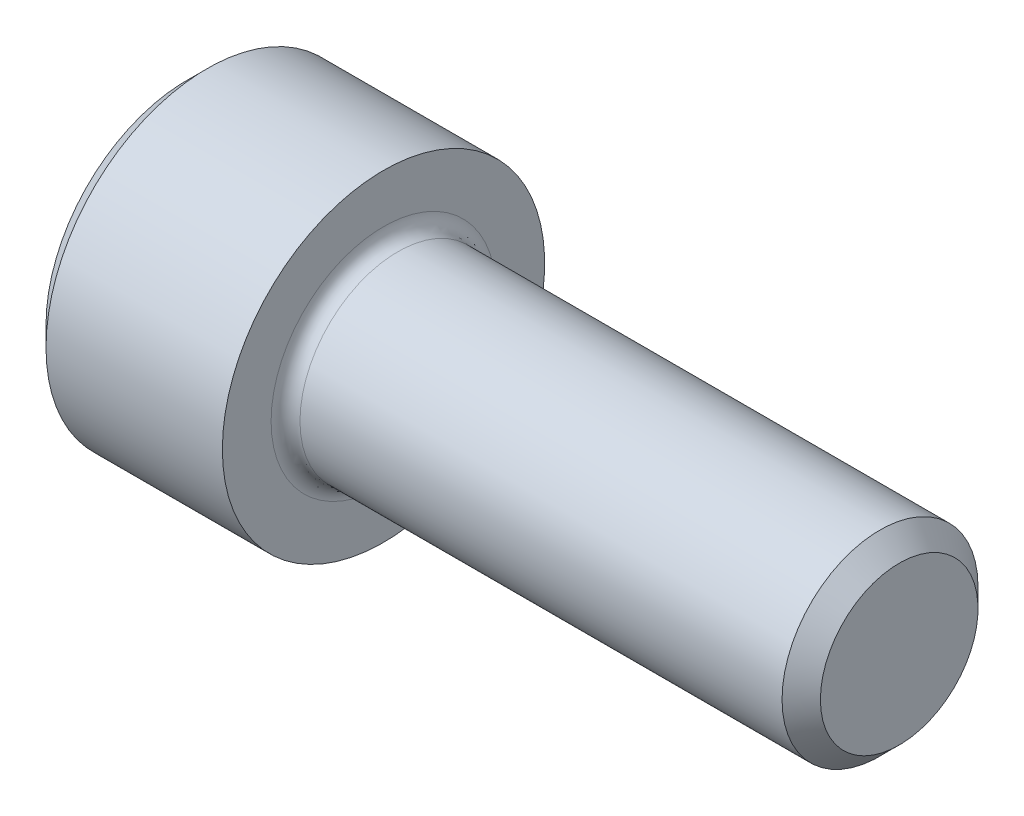
ISO-10303-21;
HEADER;
FILE_DESCRIPTION(('STEP AP214'),'2;1');
FILE_NAME('part.step','',(''),(''),'','','');
FILE_SCHEMA(('AUTOMOTIVE_DESIGN { 1 0 10303 214 1 1 1 1 }'));
ENDSEC;
DATA;
#1=APPLICATION_CONTEXT('core data for automotive mechanical design processes');
#2=APPLICATION_PROTOCOL_DEFINITION('international standard','automotive_design',2000,#1);
#3=PRODUCT_CONTEXT('',#1,'mechanical');
#4=PRODUCT('Part','Part','',(#3));
#5=PRODUCT_RELATED_PRODUCT_CATEGORY('part','',(#4));
#6=PRODUCT_DEFINITION_FORMATION('','',#4);
#7=PRODUCT_DEFINITION_CONTEXT('part definition',#1,'design');
#8=PRODUCT_DEFINITION('design','',#6,#7);
#9=PRODUCT_DEFINITION_SHAPE('','',#8);
#10=(LENGTH_UNIT() NAMED_UNIT(*) SI_UNIT(.MILLI.,.METRE.));
#11=(NAMED_UNIT(*) PLANE_ANGLE_UNIT() SI_UNIT($,.RADIAN.));
#12=(NAMED_UNIT(*) SI_UNIT($,.STERADIAN.) SOLID_ANGLE_UNIT());
#13=UNCERTAINTY_MEASURE_WITH_UNIT(LENGTH_MEASURE(1.E-05),#10,'distance_accuracy_value','');
#14=(GEOMETRIC_REPRESENTATION_CONTEXT(3) GLOBAL_UNCERTAINTY_ASSIGNED_CONTEXT((#13)) GLOBAL_UNIT_ASSIGNED_CONTEXT((#10,
#11,#12)) REPRESENTATION_CONTEXT('',''));
#15=CARTESIAN_POINT('',(0.,0.,0.));
#16=DIRECTION('',(0.,0.,1.));
#17=DIRECTION('',(1.,0.,0.));
#18=AXIS2_PLACEMENT_3D('',#15,#16,#17);
#19=CARTESIAN_POINT('',(17.5259999996129,0.,0.));
#20=DIRECTION('',(1.,0.,0.));
#21=DIRECTION('',(0.,0.,-1.));
#22=AXIS2_PLACEMENT_3D('',#19,#20,#21);
#23=PLANE('',#22);
#24=CARTESIAN_POINT('',(17.526,0.,0.));
#25=DIRECTION('',(-1.,0.,0.));
#26=DIRECTION('',(0.,0.,1.));
#27=AXIS2_PLACEMENT_3D('',#24,#25,#26);
#28=CIRCLE('',#27,1.94056);
#29=CARTESIAN_POINT('',(17.526,0.,1.94056));
#30=VERTEX_POINT('',#29);
#31=EDGE_CURVE('E138',#30,#30,#28,.F.);
#32=ORIENTED_EDGE('',*,*,#31,.T.);
#33=EDGE_LOOP('',(#32));
#34=FACE_BOUND('',#33,.T.);
#35=ADVANCED_FACE('F17',(#34),#23,.T.);
#36=CARTESIAN_POINT('',(17.526,0.,0.));
#37=DIRECTION('',(-1.,0.,0.));
#38=DIRECTION('',(0.,0.,1.));
#39=AXIS2_PLACEMENT_3D('',#36,#37,#38);
#40=CONICAL_SURFACE('',#39,1.94056,0.785398163397448);
#41=ORIENTED_EDGE('',*,*,#31,.F.);
#42=EDGE_LOOP('',(#41));
#43=FACE_BOUND('',#42,.T.);
#44=CARTESIAN_POINT('',(17.05356,0.,0.));
#45=DIRECTION('',(-1.,0.,0.));
#46=DIRECTION('',(0.,0.,-1.));
#47=AXIS2_PLACEMENT_3D('',#44,#45,#46);
#48=CIRCLE('',#47,2.413);
#49=CARTESIAN_POINT('',(17.05356,0.,-2.413));
#50=VERTEX_POINT('',#49);
#51=EDGE_CURVE('E140',#50,#50,#48,.F.);
#52=ORIENTED_EDGE('',*,*,#51,.T.);
#53=EDGE_LOOP('',(#52));
#54=FACE_BOUND('',#53,.T.);
#55=ADVANCED_FACE('F509',(#43,#54),#40,.T.);
#56=CARTESIAN_POINT('',(17.05356,0.,0.));
#57=DIRECTION('',(-1.,0.,0.));
#58=DIRECTION('',(0.,0.,1.));
#59=AXIS2_PLACEMENT_3D('',#56,#57,#58);
#60=CYLINDRICAL_SURFACE('',#59,2.413);
#61=ORIENTED_EDGE('',*,*,#51,.F.);
#62=EDGE_LOOP('',(#61));
#63=FACE_BOUND('',#62,.T.);
#64=CARTESIAN_POINT('',(5.1816,0.,0.));
#65=DIRECTION('',(1.,0.,0.));
#66=DIRECTION('',(0.,0.,1.));
#67=AXIS2_PLACEMENT_3D('',#64,#65,#66);
#68=CIRCLE('',#67,2.413);
#69=CARTESIAN_POINT('',(5.1816,0.,2.413));
#70=VERTEX_POINT('',#69);
#71=EDGE_CURVE('E150',#70,#70,#68,.T.);
#72=ORIENTED_EDGE('',*,*,#71,.T.);
#73=EDGE_LOOP('',(#72));
#74=FACE_BOUND('',#73,.T.);
#75=ADVANCED_FACE('F179',(#63,#74),#60,.T.);
#76=CARTESIAN_POINT('',(5.1816,0.,2.413));
#77=CARTESIAN_POINT('',(4.97329434277987,0.,2.413));
#78=CARTESIAN_POINT('',(4.826,0.,2.56029434277987));
#79=CARTESIAN_POINT('',(4.826,0.,2.7686));
#80=(BOUNDED_CURVE() B_SPLINE_CURVE(3,(#76,#77,#78,#79),.UNSPECIFIED.,.F.,
.F.) B_SPLINE_CURVE_WITH_KNOTS((4,4),(0.,1.),
.UNSPECIFIED.) CURVE() GEOMETRIC_REPRESENTATION_ITEM() RATIONAL_B_SPLINE_CURVE((1.,
0.804737854124365,0.804737854124365,1.)) REPRESENTATION_ITEM(''));
#81=CARTESIAN_POINT('',(5.1816,0.,0.));
#82=DIRECTION('',(1.,0.,0.));
#83=AXIS1_PLACEMENT('',#81,#82);
#84=SURFACE_OF_REVOLUTION('',#80,#83);
#85=CARTESIAN_POINT('',(4.826,0.,0.));
#86=DIRECTION('',(1.,0.,0.));
#87=DIRECTION('',(0.,0.,1.));
#88=AXIS2_PLACEMENT_3D('',#85,#86,#87);
#89=CIRCLE('',#88,2.7686);
#90=CARTESIAN_POINT('',(4.82600000010323,0.,2.7686));
#91=VERTEX_POINT('',#90);
#92=CARTESIAN_POINT('',(4.82600000010323,0.,-2.7686));
#93=VERTEX_POINT('',#92);
#94=EDGE_CURVE('E137',#91,#93,#89,.T.);
#95=ORIENTED_EDGE('',*,*,#94,.T.);
#96=CARTESIAN_POINT('',(4.826,0.,0.));
#97=DIRECTION('',(1.,0.,0.));
#98=DIRECTION('',(0.,0.,-1.));
#99=AXIS2_PLACEMENT_3D('',#96,#97,#98);
#100=CIRCLE('',#99,2.7686);
#101=EDGE_CURVE('E143',#93,#91,#100,.T.);
#102=ORIENTED_EDGE('',*,*,#101,.T.);
#103=EDGE_LOOP('',(#95,#102));
#104=FACE_BOUND('',#103,.T.);
#105=ORIENTED_EDGE('',*,*,#71,.F.);
#106=EDGE_LOOP('',(#105));
#107=FACE_BOUND('',#106,.T.);
#108=ADVANCED_FACE('F145',(#104,#107),#84,.F.);
#109=CARTESIAN_POINT('',(4.82600000025806,0.,0.));
#110=DIRECTION('',(1.,0.,0.));
#111=DIRECTION('',(0.,0.,-1.));
#112=AXIS2_PLACEMENT_3D('',#109,#110,#111);
#113=PLANE('',#112);
#114=ORIENTED_EDGE('',*,*,#101,.F.);
#115=ORIENTED_EDGE('',*,*,#94,.F.);
#116=EDGE_LOOP('',(#114,#115));
#117=FACE_BOUND('',#116,.T.);
#118=CARTESIAN_POINT('',(4.826,0.,0.));
#119=DIRECTION('',(-1.,0.,0.));
#120=DIRECTION('',(0.,0.,1.));
#121=AXIS2_PLACEMENT_3D('',#118,#119,#120);
#122=CIRCLE('',#121,3.96875);
#123=CARTESIAN_POINT('',(4.826,0.,3.96875));
#124=VERTEX_POINT('',#123);
#125=EDGE_CURVE('E133',#124,#124,#122,.F.);
#126=ORIENTED_EDGE('',*,*,#125,.T.);
#127=EDGE_LOOP('',(#126));
#128=FACE_BOUND('',#127,.T.);
#129=ADVANCED_FACE('F152',(#117,#128),#113,.T.);
#130=CARTESIAN_POINT('',(4.826,0.,0.));
#131=DIRECTION('',(-1.,0.,0.));
#132=DIRECTION('',(0.,0.,1.));
#133=AXIS2_PLACEMENT_3D('',#130,#131,#132);
#134=CYLINDRICAL_SURFACE('',#133,3.96875);
#135=ORIENTED_EDGE('',*,*,#125,.F.);
#136=EDGE_LOOP('',(#135));
#137=FACE_BOUND('',#136,.T.);
#138=CARTESIAN_POINT('',(0.4826,0.,0.));
#139=DIRECTION('',(1.,0.,0.));
#140=DIRECTION('',(0.,0.,-1.));
#141=AXIS2_PLACEMENT_3D('',#138,#139,#140);
#142=CIRCLE('',#141,3.96875);
#143=CARTESIAN_POINT('',(0.4826,0.,-3.96875));
#144=VERTEX_POINT('',#143);
#145=CARTESIAN_POINT('',(0.4826,0.,3.96875));
#146=VERTEX_POINT('',#145);
#147=EDGE_CURVE('E136',#144,#146,#142,.T.);
#148=ORIENTED_EDGE('',*,*,#147,.T.);
#149=CARTESIAN_POINT('',(0.4826,0.,0.));
#150=DIRECTION('',(1.,0.,0.));
#151=DIRECTION('',(0.,0.,1.));
#152=AXIS2_PLACEMENT_3D('',#149,#150,#151);
#153=CIRCLE('',#152,3.96875);
#154=EDGE_CURVE('E121',#146,#144,#153,.T.);
#155=ORIENTED_EDGE('',*,*,#154,.T.);
#156=EDGE_LOOP('',(#148,#155));
#157=FACE_BOUND('',#156,.T.);
#158=ADVANCED_FACE('F173',(#137,#157),#134,.T.);
#159=CARTESIAN_POINT('',(0.,0.,0.));
#160=DIRECTION('',(1.,0.,0.));
#161=DIRECTION('',(0.,0.,-1.));
#162=AXIS2_PLACEMENT_3D('',#159,#160,#161);
#163=CONICAL_SURFACE('',#162,3.48615,0.785398163397448);
#164=DIRECTION('',(0.707106781246854,0.,0.707106781126241));
#165=VECTOR('',#164,1.);
#166=CARTESIAN_POINT('',(0.241299999958841,0.,3.72745));
#167=LINE('',#166,#165);
#168=CARTESIAN_POINT('',(0.,0.,3.48615000004116));
#169=VERTEX_POINT('',#168);
#170=EDGE_CURVE('E112',#169,#146,#167,.T.);
#171=ORIENTED_EDGE('',*,*,#170,.T.);
#172=ORIENTED_EDGE('',*,*,#147,.F.);
#173=DIRECTION('',(-0.707106781246854,0.,0.707106781126241));
#174=VECTOR('',#173,1.);
#175=CARTESIAN_POINT('',(0.241299999958841,0.,-3.72745));
#176=LINE('',#175,#174);
#177=CARTESIAN_POINT('',(-2.05793803479181E-11,0.,-3.48615000006174));
#178=VERTEX_POINT('',#177);
#179=EDGE_CURVE('E105',#144,#178,#176,.T.);
#180=ORIENTED_EDGE('',*,*,#179,.T.);
#181=CARTESIAN_POINT('',(0.,0.,0.));
#182=DIRECTION('',(1.,0.,0.));
#183=DIRECTION('',(0.,0.,-1.));
#184=AXIS2_PLACEMENT_3D('',#181,#182,#183);
#185=CIRCLE('',#184,3.48615);
#186=EDGE_CURVE('E109',#178,#169,#185,.T.);
#187=ORIENTED_EDGE('',*,*,#186,.T.);
#188=EDGE_LOOP('',(#171,#172,#180,#187));
#189=FACE_BOUND('',#188,.T.);
#190=ADVANCED_FACE('F111',(#189),#163,.T.);
#191=CARTESIAN_POINT('',(-8.23180635068E-11,0.,0.));
#192=DIRECTION('',(1.,0.,0.));
#193=DIRECTION('',(0.,0.,-1.));
#194=AXIS2_PLACEMENT_3D('',#191,#192,#193);
#195=CONICAL_SURFACE('',#194,3.48615,0.785398163312162);
#196=CARTESIAN_POINT('',(-4.11587878008906E-11,0.,0.));
#197=DIRECTION('',(1.,0.,0.));
#198=DIRECTION('',(0.,0.,-1.));
#199=AXIS2_PLACEMENT_3D('',#196,#197,#198);
#200=CIRCLE('',#199,3.48615000004116);
#201=EDGE_CURVE('E116',#169,#178,#200,.T.);
#202=ORIENTED_EDGE('',*,*,#201,.T.);
#203=ORIENTED_EDGE('',*,*,#179,.F.);
#204=ORIENTED_EDGE('',*,*,#154,.F.);
#205=ORIENTED_EDGE('',*,*,#170,.F.);
#206=EDGE_LOOP('',(#202,#203,#204,#205));
#207=FACE_BOUND('',#206,.T.);
#208=ADVANCED_FACE('F120',(#207),#195,.T.);
#209=CARTESIAN_POINT('',(0.,-1.71906908697358,0.992505000056698));
#210=DIRECTION('',(0.,0.866025403798195,-0.499999999976173));
#211=DIRECTION('',(0.,0.499999999976173,0.866025403798195));
#212=AXIS2_PLACEMENT_3D('',#209,#210,#211);
#213=PLANE('',#212);
#214=DIRECTION('',(1.,0.,0.));
#215=VECTOR('',#214,1.);
#216=CARTESIAN_POINT('',(0.,-1.146046057408,1.98501000030258));
#217=LINE('',#216,#215);
#218=CARTESIAN_POINT('',(0.,-1.1460460575285,1.98501000008311));
#219=VERTEX_POINT('',#218);
#220=CARTESIAN_POINT('',(2.28600000004301,-1.1460460576285,1.98501000023126));
#221=VERTEX_POINT('',#220);
#222=EDGE_CURVE('E309',#219,#221,#217,.T.);
#223=ORIENTED_EDGE('',*,*,#222,.T.);
#224=DIRECTION('',(0.,0.499999999976173,0.866025403798195));
#225=VECTOR('',#224,1.);
#226=CARTESIAN_POINT('',(2.286,-1.71906908697358,0.992505000056698));
#227=LINE('',#226,#225);
#228=CARTESIAN_POINT('',(2.28599999999421,-1.71906908688241,0.992505000026677));
#229=VERTEX_POINT('',#228);
#230=EDGE_CURVE('E279',#229,#221,#227,.T.);
#231=ORIENTED_EDGE('',*,*,#230,.F.);
#232=DIRECTION('',(0.,0.499999999976173,0.866025403798195));
#233=VECTOR('',#232,1.);
#234=CARTESIAN_POINT('',(2.286,-1.71906908697358,0.992505000056698));
#235=LINE('',#234,#233);
#236=CARTESIAN_POINT('',(2.286,-2.2920921157547,-3.96231369474235E-10));
#237=VERTEX_POINT('',#236);
#238=EDGE_CURVE('E122',#237,#229,#235,.T.);
#239=ORIENTED_EDGE('',*,*,#238,.F.);
#240=DIRECTION('',(1.,0.,0.));
#241=VECTOR('',#240,1.);
#242=CARTESIAN_POINT('',(0.,-2.29209211561744,-4.75477730105256E-10));
#243=LINE('',#242,#241);
#244=CARTESIAN_POINT('',(0.,-2.29209211626848,-1.58492323721245E-10));
#245=VERTEX_POINT('',#244);
#246=EDGE_CURVE('E117',#237,#245,#243,.F.);
#247=ORIENTED_EDGE('',*,*,#246,.T.);
#248=DIRECTION('',(0.,0.500000000439086,0.866025403530932));
#249=VECTOR('',#248,1.);
#250=CARTESIAN_POINT('',(0.,-2.292092116594,0.));
#251=LINE('',#250,#249);
#252=EDGE_CURVE('E243',#245,#219,#251,.T.);
#253=ORIENTED_EDGE('',*,*,#252,.T.);
#254=EDGE_LOOP('',(#223,#231,#239,#247,#253));
#255=FACE_BOUND('',#254,.T.);
#256=ADVANCED_FACE('F382',(#255),#213,.T.);
#257=CARTESIAN_POINT('',(0.,0.,1.98501000030258));
#258=DIRECTION('',(0.,0.,1.));
#259=DIRECTION('',(1.,0.,0.));
#260=AXIS2_PLACEMENT_3D('',#257,#258,#259);
#261=PLANE('',#260);
#262=DIRECTION('',(1.,0.,0.));
#263=VECTOR('',#262,1.);
#264=CARTESIAN_POINT('',(0.,1.1460460579425,1.9850100003086));
#265=LINE('',#264,#263);
#266=CARTESIAN_POINT('',(0.,1.1460460576425,1.98501000021103));
#267=VERTEX_POINT('',#266);
#268=CARTESIAN_POINT('',(2.28600000004301,1.14604605776434,1.98501000030659));
#269=VERTEX_POINT('',#268);
#270=EDGE_CURVE('E293',#267,#269,#265,.T.);
#271=ORIENTED_EDGE('',*,*,#270,.T.);
#272=DIRECTION('',(0.,1.,0.));
#273=VECTOR('',#272,1.);
#274=CARTESIAN_POINT('',(2.286,0.,1.98501000030258));
#275=LINE('',#274,#273);
#276=CARTESIAN_POINT('',(2.286,0.,1.98501000015129));
#277=VERTEX_POINT('',#276);
#278=EDGE_CURVE('E298',#277,#269,#275,.T.);
#279=ORIENTED_EDGE('',*,*,#278,.F.);
#280=DIRECTION('',(0.,1.,0.));
#281=VECTOR('',#280,1.);
#282=CARTESIAN_POINT('',(2.286,0.,1.98501000030258));
#283=LINE('',#282,#281);
#284=EDGE_CURVE('E302',#221,#277,#283,.T.);
#285=ORIENTED_EDGE('',*,*,#284,.F.);
#286=ORIENTED_EDGE('',*,*,#222,.F.);
#287=DIRECTION('',(0.,1.,0.));
#288=VECTOR('',#287,1.);
#289=CARTESIAN_POINT('',(0.,0.,1.98501));
#290=LINE('',#289,#288);
#291=EDGE_CURVE('E260',#219,#267,#290,.T.);
#292=ORIENTED_EDGE('',*,*,#291,.T.);
#293=EDGE_LOOP('',(#271,#279,#285,#286,#292));
#294=FACE_BOUND('',#293,.T.);
#295=ADVANCED_FACE('F378',(#294),#261,.F.);
#296=CARTESIAN_POINT('',(0.,1.71906908697358,0.992505000056698));
#297=DIRECTION('',(0.,-0.866025403798195,-0.499999999976173));
#298=DIRECTION('',(0.,0.499999999976173,-0.866025403798195));
#299=AXIS2_PLACEMENT_3D('',#296,#297,#298);
#300=PLANE('',#299);
#301=DIRECTION('',(1.,0.,0.));
#302=VECTOR('',#301,1.);
#303=CARTESIAN_POINT('',(0.,2.29209211606747,3.03995327174955E-10));
#304=LINE('',#303,#302);
#305=CARTESIAN_POINT('',(0.,2.29209211641849,1.01331545656366E-10));
#306=VERTEX_POINT('',#305);
#307=CARTESIAN_POINT('',(2.286,2.2920921159828,2.47978720890885E-10));
#308=VERTEX_POINT('',#307);
#309=EDGE_CURVE('E263',#306,#308,#304,.T.);
#310=ORIENTED_EDGE('',*,*,#309,.T.);
#311=DIRECTION('',(0.,0.499999999976173,-0.866025403798195));
#312=VECTOR('',#311,1.);
#313=CARTESIAN_POINT('',(2.286,1.71906908697358,0.992505000056698));
#314=LINE('',#313,#312);
#315=CARTESIAN_POINT('',(2.286,1.71906908711514,0.992504999811503));
#316=VERTEX_POINT('',#315);
#317=EDGE_CURVE('E266',#316,#308,#314,.T.);
#318=ORIENTED_EDGE('',*,*,#317,.F.);
#319=DIRECTION('',(0.,0.499999999976173,-0.866025403798195));
#320=VECTOR('',#319,1.);
#321=CARTESIAN_POINT('',(2.286,1.71906908697358,0.992505000056698));
#322=LINE('',#321,#320);
#323=EDGE_CURVE('E289',#269,#316,#322,.T.);
#324=ORIENTED_EDGE('',*,*,#323,.F.);
#325=ORIENTED_EDGE('',*,*,#270,.F.);
#326=DIRECTION('',(0.,0.500000000439086,-0.866025403530932));
#327=VECTOR('',#326,1.);
#328=CARTESIAN_POINT('',(0.,1.146046057408,1.98501));
#329=LINE('',#328,#327);
#330=EDGE_CURVE('E232',#267,#306,#329,.T.);
#331=ORIENTED_EDGE('',*,*,#330,.T.);
#332=EDGE_LOOP('',(#310,#318,#324,#325,#331));
#333=FACE_BOUND('',#332,.T.);
#334=ADVANCED_FACE('F374',(#333),#300,.T.);
#335=CARTESIAN_POINT('',(0.,1.71906908697358,-0.992505000056698));
#336=DIRECTION('',(0.,0.866025403798195,-0.499999999976173));
#337=DIRECTION('',(0.,0.499999999976173,0.866025403798195));
#338=AXIS2_PLACEMENT_3D('',#335,#336,#337);
#339=PLANE('',#338);
#340=DIRECTION('',(-1.,0.,0.));
#341=VECTOR('',#340,1.);
#342=CARTESIAN_POINT('',(0.,1.146046057408,-1.98501000030258));
#343=LINE('',#342,#341);
#344=CARTESIAN_POINT('',(0.,1.14604605736433,-1.98501000027737));
#345=VERTEX_POINT('',#344);
#346=CARTESIAN_POINT('',(2.28600000017204,1.14604605779784,-1.9850100001304));
#347=VERTEX_POINT('',#346);
#348=EDGE_CURVE('E227',#345,#347,#343,.F.);
#349=ORIENTED_EDGE('',*,*,#348,.T.);
#350=DIRECTION('',(0.,0.499999999976173,0.866025403798195));
#351=VECTOR('',#350,1.);
#352=CARTESIAN_POINT('',(2.286,1.71906908697358,-0.992505000056698));
#353=LINE('',#352,#351);
#354=CARTESIAN_POINT('',(2.286,1.71906908711514,-0.992504999811503));
#355=VERTEX_POINT('',#354);
#356=EDGE_CURVE('E238',#355,#347,#353,.F.);
#357=ORIENTED_EDGE('',*,*,#356,.F.);
#358=DIRECTION('',(0.,0.499999999976173,0.866025403798195));
#359=VECTOR('',#358,1.);
#360=CARTESIAN_POINT('',(2.286,1.71906908697358,-0.992505000056698));
#361=LINE('',#360,#359);
#362=EDGE_CURVE('E251',#308,#355,#361,.F.);
#363=ORIENTED_EDGE('',*,*,#362,.F.);
#364=ORIENTED_EDGE('',*,*,#309,.F.);
#365=DIRECTION('',(0.,-0.500000000439086,-0.866025403530932));
#366=VECTOR('',#365,1.);
#367=CARTESIAN_POINT('',(0.,2.292092116594,0.));
#368=LINE('',#367,#366);
#369=EDGE_CURVE('E125',#306,#345,#368,.T.);
#370=ORIENTED_EDGE('',*,*,#369,.T.);
#371=EDGE_LOOP('',(#349,#357,#363,#364,#370));
#372=FACE_BOUND('',#371,.T.);
#373=ADVANCED_FACE('F370',(#372),#339,.F.);
#374=CARTESIAN_POINT('',(0.,-1.71906908697358,-0.992505000056698));
#375=DIRECTION('',(0.,0.866025403798195,0.499999999976173));
#376=DIRECTION('',(0.,-0.499999999976173,0.866025403798195));
#377=AXIS2_PLACEMENT_3D('',#374,#375,#376);
#378=PLANE('',#377);
#379=ORIENTED_EDGE('',*,*,#246,.F.);
#380=DIRECTION('',(0.,-0.499999999976173,0.866025403798195));
#381=VECTOR('',#380,1.);
#382=CARTESIAN_POINT('',(2.286,-1.71906908697358,-0.992505000056698));
#383=LINE('',#382,#381);
#384=CARTESIAN_POINT('',(2.28599999999421,-1.71906908688224,-0.992505000026975));
#385=VERTEX_POINT('',#384);
#386=EDGE_CURVE('E237',#385,#237,#383,.T.);
#387=ORIENTED_EDGE('',*,*,#386,.F.);
#388=DIRECTION('',(0.,-0.499999999976173,0.866025403798195));
#389=VECTOR('',#388,1.);
#390=CARTESIAN_POINT('',(2.286,-1.71906908697358,-0.992505000056698));
#391=LINE('',#390,#389);
#392=CARTESIAN_POINT('',(2.28600000017204,-1.14604605758617,-1.98501000045773));
#393=VERTEX_POINT('',#392);
#394=EDGE_CURVE('E235',#393,#385,#391,.T.);
#395=ORIENTED_EDGE('',*,*,#394,.F.);
#396=DIRECTION('',(-1.,0.,0.));
#397=VECTOR('',#396,1.);
#398=CARTESIAN_POINT('',(0.,-1.146046057408,-1.98501000030258));
#399=LINE('',#398,#397);
#400=CARTESIAN_POINT('',(0.,-1.14604605736433,-1.98501000027737));
#401=VERTEX_POINT('',#400);
#402=EDGE_CURVE('E225',#393,#401,#399,.T.);
#403=ORIENTED_EDGE('',*,*,#402,.T.);
#404=DIRECTION('',(0.,-0.500000000439086,0.866025403530932));
#405=VECTOR('',#404,1.);
#406=CARTESIAN_POINT('',(0.,-1.146046057408,-1.98501));
#407=LINE('',#406,#405);
#408=EDGE_CURVE('E127',#401,#245,#407,.T.);
#409=ORIENTED_EDGE('',*,*,#408,.T.);
#410=EDGE_LOOP('',(#379,#387,#395,#403,#409));
#411=FACE_BOUND('',#410,.T.);
#412=ADVANCED_FACE('F366',(#411),#378,.T.);
#413=CARTESIAN_POINT('',(0.,0.,0.));
#414=DIRECTION('',(-1.,0.,0.));
#415=DIRECTION('',(0.,0.,1.));
#416=AXIS2_PLACEMENT_3D('',#413,#414,#415);
#417=PLANE('',#416);
#418=ORIENTED_EDGE('',*,*,#291,.F.);
#419=ORIENTED_EDGE('',*,*,#252,.F.);
#420=ORIENTED_EDGE('',*,*,#408,.F.);
#421=DIRECTION('',(0.,1.,0.));
#422=VECTOR('',#421,1.);
#423=CARTESIAN_POINT('',(0.,0.,-1.98501000030258));
#424=LINE('',#423,#422);
#425=EDGE_CURVE('E218',#401,#345,#424,.T.);
#426=ORIENTED_EDGE('',*,*,#425,.T.);
#427=ORIENTED_EDGE('',*,*,#369,.F.);
#428=ORIENTED_EDGE('',*,*,#330,.F.);
#429=EDGE_LOOP('',(#418,#419,#420,#426,#427,#428));
#430=FACE_BOUND('',#429,.T.);
#431=ORIENTED_EDGE('',*,*,#186,.F.);
#432=ORIENTED_EDGE('',*,*,#201,.F.);
#433=EDGE_LOOP('',(#431,#432));
#434=FACE_BOUND('',#433,.T.);
#435=ADVANCED_FACE('F124',(#430,#434),#417,.T.);
#436=CARTESIAN_POINT('',(0.,0.,-1.98501000030258));
#437=DIRECTION('',(0.,0.,-1.));
#438=DIRECTION('',(-1.,0.,0.));
#439=AXIS2_PLACEMENT_3D('',#436,#437,#438);
#440=PLANE('',#439);
#441=ORIENTED_EDGE('',*,*,#402,.F.);
#442=DIRECTION('',(0.,1.,0.));
#443=VECTOR('',#442,1.);
#444=CARTESIAN_POINT('',(2.28600000025806,0.,-1.985010000762));
#445=LINE('',#444,#443);
#446=CARTESIAN_POINT('',(2.28600000007485,0.,-1.98501000035306));
#447=VERTEX_POINT('',#446);
#448=EDGE_CURVE('E207',#393,#447,#445,.T.);
#449=ORIENTED_EDGE('',*,*,#448,.T.);
#450=DIRECTION('',(0.,1.,0.));
#451=VECTOR('',#450,1.);
#452=CARTESIAN_POINT('',(2.28600000025806,0.,-1.98501));
#453=LINE('',#452,#451);
#454=EDGE_CURVE('E212',#447,#347,#453,.T.);
#455=ORIENTED_EDGE('',*,*,#454,.T.);
#456=ORIENTED_EDGE('',*,*,#348,.F.);
#457=ORIENTED_EDGE('',*,*,#425,.F.);
#458=EDGE_LOOP('',(#441,#449,#455,#456,#457));
#459=FACE_BOUND('',#458,.T.);
#460=ADVANCED_FACE('F361',(#459),#440,.F.);
#461=CARTESIAN_POINT('',(2.28600000025806,0.,0.));
#462=DIRECTION('',(-1.,0.,0.));
#463=DIRECTION('',(0.,0.,1.));
#464=AXIS2_PLACEMENT_3D('',#461,#462,#463);
#465=PLANE('',#464);
#466=ORIENTED_EDGE('',*,*,#356,.T.);
#467=ORIENTED_EDGE('',*,*,#454,.F.);
#468=CARTESIAN_POINT('',(2.286,0.,0.));
#469=DIRECTION('',(-1.,0.,0.));
#470=DIRECTION('',(0.,0.,1.));
#471=AXIS2_PLACEMENT_3D('',#468,#469,#470);
#472=CIRCLE('',#471,1.98501);
#473=EDGE_CURVE('E130',#447,#355,#472,.F.);
#474=ORIENTED_EDGE('',*,*,#473,.T.);
#475=EDGE_LOOP('',(#466,#467,#474));
#476=FACE_BOUND('',#475,.T.);
#477=ADVANCED_FACE('F358',(#476),#465,.T.);
#478=CARTESIAN_POINT('',(2.28600000025806,0.,0.));
#479=DIRECTION('',(-1.,0.,0.));
#480=DIRECTION('',(0.,0.,1.));
#481=AXIS2_PLACEMENT_3D('',#478,#479,#480);
#482=PLANE('',#481);
#483=ORIENTED_EDGE('',*,*,#317,.T.);
#484=ORIENTED_EDGE('',*,*,#362,.T.);
#485=CARTESIAN_POINT('',(2.286,0.,0.));
#486=DIRECTION('',(-1.,0.,0.));
#487=DIRECTION('',(0.,0.,1.));
#488=AXIS2_PLACEMENT_3D('',#485,#486,#487);
#489=CIRCLE('',#488,1.98501);
#490=EDGE_CURVE('E201',#355,#316,#489,.F.);
#491=ORIENTED_EDGE('',*,*,#490,.T.);
#492=EDGE_LOOP('',(#483,#484,#491));
#493=FACE_BOUND('',#492,.T.);
#494=ADVANCED_FACE('F354',(#493),#482,.T.);
#495=CARTESIAN_POINT('',(2.28600000025806,0.,0.));
#496=DIRECTION('',(-1.,0.,0.));
#497=DIRECTION('',(0.,0.,1.));
#498=AXIS2_PLACEMENT_3D('',#495,#496,#497);
#499=PLANE('',#498);
#500=ORIENTED_EDGE('',*,*,#278,.T.);
#501=ORIENTED_EDGE('',*,*,#323,.T.);
#502=CARTESIAN_POINT('',(2.286,0.,0.));
#503=DIRECTION('',(-1.,0.,0.));
#504=DIRECTION('',(0.,0.,1.));
#505=AXIS2_PLACEMENT_3D('',#502,#503,#504);
#506=CIRCLE('',#505,1.98501);
#507=EDGE_CURVE('E199',#316,#277,#506,.F.);
#508=ORIENTED_EDGE('',*,*,#507,.T.);
#509=EDGE_LOOP('',(#500,#501,#508));
#510=FACE_BOUND('',#509,.T.);
#511=ADVANCED_FACE('F350',(#510),#499,.T.);
#512=CARTESIAN_POINT('',(2.28600000025806,0.,0.));
#513=DIRECTION('',(-1.,0.,0.));
#514=DIRECTION('',(0.,0.,1.));
#515=AXIS2_PLACEMENT_3D('',#512,#513,#514);
#516=PLANE('',#515);
#517=ORIENTED_EDGE('',*,*,#230,.T.);
#518=ORIENTED_EDGE('',*,*,#284,.T.);
#519=CARTESIAN_POINT('',(2.286,0.,0.));
#520=DIRECTION('',(-1.,0.,0.));
#521=DIRECTION('',(0.,0.,1.));
#522=AXIS2_PLACEMENT_3D('',#519,#520,#521);
#523=CIRCLE('',#522,1.98501);
#524=EDGE_CURVE('E196',#277,#229,#523,.F.);
#525=ORIENTED_EDGE('',*,*,#524,.T.);
#526=EDGE_LOOP('',(#517,#518,#525));
#527=FACE_BOUND('',#526,.T.);
#528=ADVANCED_FACE('F346',(#527),#516,.T.);
#529=CARTESIAN_POINT('',(2.28600000025806,0.,0.));
#530=DIRECTION('',(-1.,0.,0.));
#531=DIRECTION('',(0.,0.,1.));
#532=AXIS2_PLACEMENT_3D('',#529,#530,#531);
#533=PLANE('',#532);
#534=ORIENTED_EDGE('',*,*,#386,.T.);
#535=ORIENTED_EDGE('',*,*,#238,.T.);
#536=CARTESIAN_POINT('',(2.28599999998842,0.,0.));
#537=DIRECTION('',(-1.,0.,0.));
#538=DIRECTION('',(0.,0.,1.));
#539=AXIS2_PLACEMENT_3D('',#536,#537,#538);
#540=CIRCLE('',#539,1.98501000002006);
#541=EDGE_CURVE('E28',#229,#385,#540,.F.);
#542=ORIENTED_EDGE('',*,*,#541,.T.);
#543=EDGE_LOOP('',(#534,#535,#542));
#544=FACE_BOUND('',#543,.T.);
#545=ADVANCED_FACE('F339',(#544),#533,.T.);
#546=CARTESIAN_POINT('',(2.28600000025806,0.,0.));
#547=DIRECTION('',(-1.,0.,0.));
#548=DIRECTION('',(0.,0.,1.));
#549=AXIS2_PLACEMENT_3D('',#546,#547,#548);
#550=PLANE('',#549);
#551=ORIENTED_EDGE('',*,*,#448,.F.);
#552=ORIENTED_EDGE('',*,*,#394,.T.);
#553=CARTESIAN_POINT('',(2.28599999998842,0.,0.));
#554=DIRECTION('',(-1.,0.,0.));
#555=DIRECTION('',(0.,0.,1.));
#556=AXIS2_PLACEMENT_3D('',#553,#554,#555);
#557=CIRCLE('',#556,1.98501000002006);
#558=EDGE_CURVE('E11',#385,#447,#557,.F.);
#559=ORIENTED_EDGE('',*,*,#558,.T.);
#560=EDGE_LOOP('',(#551,#552,#559));
#561=FACE_BOUND('',#560,.T.);
#562=ADVANCED_FACE('F334',(#561),#550,.T.);
#563=CARTESIAN_POINT('',(3.4320460569,0.,0.));
#564=DIRECTION('',(-1.,0.,0.));
#565=DIRECTION('',(0.,0.,1.));
#566=AXIS2_PLACEMENT_3D('',#563,#564,#565);
#567=CONICAL_SURFACE('',#566,0.,1.04719755155331);
#568=CARTESIAN_POINT('',(3.4320460569,0.,0.));
#569=VERTEX_POINT('',#568);
#570=VERTEX_LOOP('',#569);
#571=FACE_BOUND('',#570,.T.);
#572=ORIENTED_EDGE('',*,*,#473,.F.);
#573=ORIENTED_EDGE('',*,*,#558,.F.);
#574=ORIENTED_EDGE('',*,*,#541,.F.);
#575=ORIENTED_EDGE('',*,*,#524,.F.);
#576=ORIENTED_EDGE('',*,*,#507,.F.);
#577=ORIENTED_EDGE('',*,*,#490,.F.);
#578=EDGE_LOOP('',(#572,#573,#574,#575,#576,#577));
#579=FACE_BOUND('',#578,.T.);
#580=ADVANCED_FACE('F332',(#571,#579),#567,.F.);
#581=CLOSED_SHELL('',(#35,#55,#75,#108,#129,#158,#190,#208,#256,#295,#334,#373,#412,#435,#460,
#477,#494,#511,#528,#545,#562,#580));
#582=MANIFOLD_SOLID_BREP('B1',#581);
#583=ADVANCED_BREP_SHAPE_REPRESENTATION('',(#18,#582),#14);
#584=SHAPE_DEFINITION_REPRESENTATION(#9,#583);
ENDSEC;
END-ISO-10303-21;
